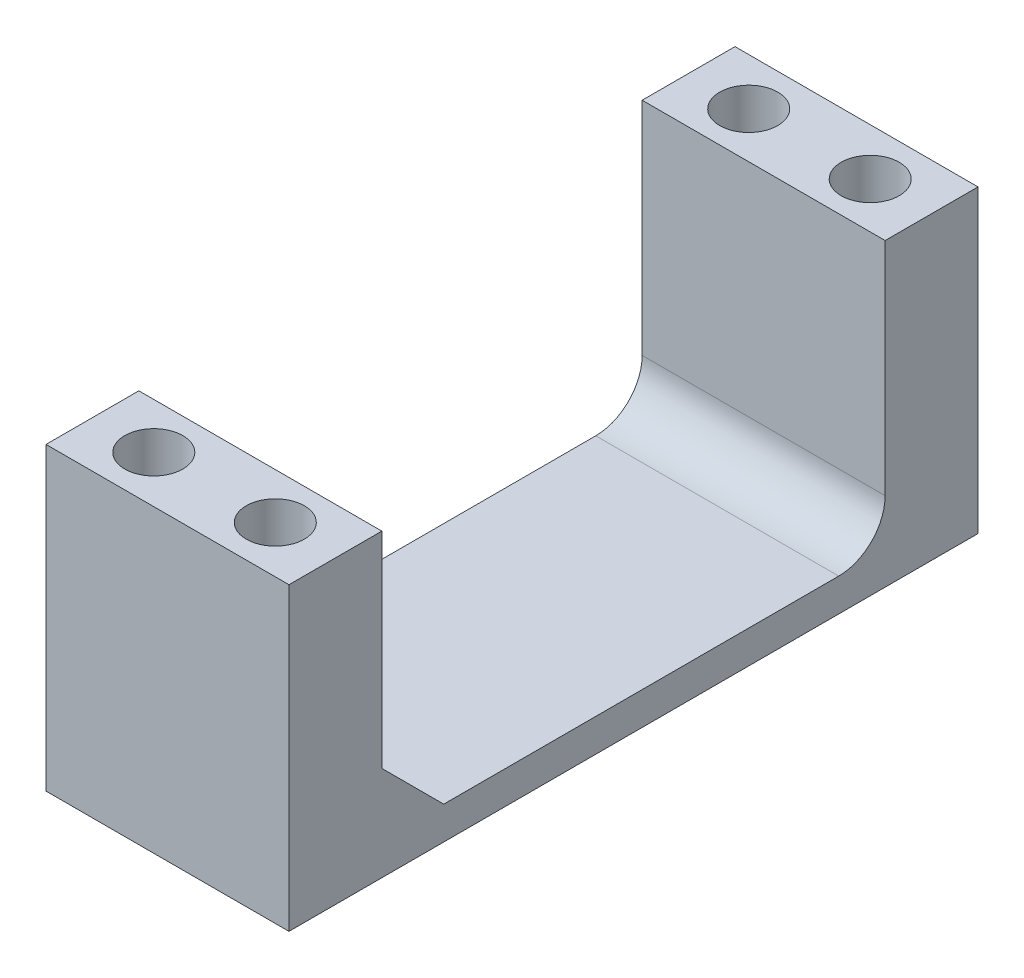
ISO-10303-21;
HEADER;
FILE_DESCRIPTION(('STEP AP214'),'2;1');
FILE_NAME('part.step','',(''),(''),'','','');
FILE_SCHEMA(('AUTOMOTIVE_DESIGN { 1 0 10303 214 1 1 1 1 }'));
ENDSEC;
DATA;
#1=APPLICATION_CONTEXT('core data for automotive mechanical design processes');
#2=APPLICATION_PROTOCOL_DEFINITION('international standard','automotive_design',2000,#1);
#3=PRODUCT_CONTEXT('',#1,'mechanical');
#4=PRODUCT('Part','Part','',(#3));
#5=PRODUCT_RELATED_PRODUCT_CATEGORY('part','',(#4));
#6=PRODUCT_DEFINITION_FORMATION('','',#4);
#7=PRODUCT_DEFINITION_CONTEXT('part definition',#1,'design');
#8=PRODUCT_DEFINITION('design','',#6,#7);
#9=PRODUCT_DEFINITION_SHAPE('','',#8);
#10=(LENGTH_UNIT() NAMED_UNIT(*) SI_UNIT(.MILLI.,.METRE.));
#11=(NAMED_UNIT(*) PLANE_ANGLE_UNIT() SI_UNIT($,.RADIAN.));
#12=(NAMED_UNIT(*) SI_UNIT($,.STERADIAN.) SOLID_ANGLE_UNIT());
#13=UNCERTAINTY_MEASURE_WITH_UNIT(LENGTH_MEASURE(1.E-05),#10,'distance_accuracy_value','');
#14=(GEOMETRIC_REPRESENTATION_CONTEXT(3) GLOBAL_UNCERTAINTY_ASSIGNED_CONTEXT((#13)) GLOBAL_UNIT_ASSIGNED_CONTEXT((#10,
#11,#12)) REPRESENTATION_CONTEXT('',''));
#15=CARTESIAN_POINT('',(0.,0.,0.));
#16=DIRECTION('',(0.,0.,1.));
#17=DIRECTION('',(1.,0.,0.));
#18=AXIS2_PLACEMENT_3D('',#15,#16,#17);
#19=CARTESIAN_POINT('',(44.4602134747078,3.59191471698541,-38.4071046370634));
#20=DIRECTION('',(0.,1.,0.));
#21=DIRECTION('',(0.,0.,1.));
#22=AXIS2_PLACEMENT_3D('',#19,#20,#21);
#23=PLANE('',#22);
#24=CARTESIAN_POINT('',(59.4144634747078,3.59191471698541,-34.5463046370634));
#25=DIRECTION('',(0.,1.,0.));
#26=DIRECTION('',(0.,0.,1.));
#27=AXIS2_PLACEMENT_3D('',#24,#25,#26);
#28=CIRCLE('',#27,2.38125);
#29=CARTESIAN_POINT('',(59.4144634747078,3.59191471698541,-32.1650546370634));
#30=VERTEX_POINT('',#29);
#31=EDGE_CURVE('E283',#30,#30,#28,.T.);
#32=ORIENTED_EDGE('',*,*,#31,.F.);
#33=EDGE_LOOP('',(#32));
#34=FACE_BOUND('',#33,.T.);
#35=CARTESIAN_POINT('',(49.4449634747078,3.59191471698541,-34.5463046370634));
#36=DIRECTION('',(0.,1.,0.));
#37=DIRECTION('',(0.,0.,1.));
#38=AXIS2_PLACEMENT_3D('',#35,#36,#37);
#39=CIRCLE('',#38,2.38125);
#40=CARTESIAN_POINT('',(49.4449634747078,3.59191471698541,-32.1650546370634));
#41=VERTEX_POINT('',#40);
#42=EDGE_CURVE('E288',#41,#41,#39,.T.);
#43=ORIENTED_EDGE('',*,*,#42,.F.);
#44=EDGE_LOOP('',(#43));
#45=FACE_BOUND('',#44,.T.);
#46=DIRECTION('',(0.,0.,1.));
#47=VECTOR('',#46,1.);
#48=CARTESIAN_POINT('',(64.3992134747078,3.59191471698541,-38.4071046370634));
#49=LINE('',#48,#47);
#50=CARTESIAN_POINT('',(64.3992134747078,3.59191471698541,-38.4071046370634));
#51=VERTEX_POINT('',#50);
#52=CARTESIAN_POINT('',(64.3992134747078,3.59191471698541,-30.7871046370634));
#53=VERTEX_POINT('',#52);
#54=EDGE_CURVE('E154',#51,#53,#49,.T.);
#55=ORIENTED_EDGE('',*,*,#54,.F.);
#56=DIRECTION('',(1.,0.,0.));
#57=VECTOR('',#56,1.);
#58=CARTESIAN_POINT('',(44.4602134747078,3.59191471698541,-38.4071046370634));
#59=LINE('',#58,#57);
#60=CARTESIAN_POINT('',(44.4602134747078,3.59191471698541,-38.4071046370634));
#61=VERTEX_POINT('',#60);
#62=EDGE_CURVE('E131',#61,#51,#59,.T.);
#63=ORIENTED_EDGE('',*,*,#62,.F.);
#64=DIRECTION('',(0.,0.,1.));
#65=VECTOR('',#64,1.);
#66=CARTESIAN_POINT('',(44.4602134747078,3.59191471698541,-38.4071046370634));
#67=LINE('',#66,#65);
#68=CARTESIAN_POINT('',(44.4602134747078,3.59191471698541,-30.7871046370634));
#69=VERTEX_POINT('',#68);
#70=EDGE_CURVE('E126',#61,#69,#67,.T.);
#71=ORIENTED_EDGE('',*,*,#70,.T.);
#72=DIRECTION('',(1.,0.,0.));
#73=VECTOR('',#72,1.);
#74=CARTESIAN_POINT('',(44.4602134747078,3.59191471698541,-30.7871046370634));
#75=LINE('',#74,#73);
#76=EDGE_CURVE('E108',#69,#53,#75,.T.);
#77=ORIENTED_EDGE('',*,*,#76,.T.);
#78=EDGE_LOOP('',(#55,#63,#71,#77));
#79=FACE_BOUND('',#78,.T.);
#80=ADVANCED_FACE('F33',(#34,#45,#79),#23,.T.);
#81=CARTESIAN_POINT('',(44.4602134747078,-21.0460852830146,-38.4071046370634));
#82=DIRECTION('',(0.,0.,-1.));
#83=DIRECTION('',(-1.,0.,0.));
#84=AXIS2_PLACEMENT_3D('',#81,#82,#83);
#85=PLANE('',#84);
#86=DIRECTION('',(0.,1.,0.));
#87=VECTOR('',#86,1.);
#88=CARTESIAN_POINT('',(64.3992134747078,-21.0460852830146,-38.4071046370634));
#89=LINE('',#88,#87);
#90=CARTESIAN_POINT('',(64.3992134747078,-21.0460852830146,-38.4071046370634));
#91=VERTEX_POINT('',#90);
#92=EDGE_CURVE('E132',#91,#51,#89,.T.);
#93=ORIENTED_EDGE('',*,*,#92,.F.);
#94=DIRECTION('',(1.,0.,0.));
#95=VECTOR('',#94,1.);
#96=CARTESIAN_POINT('',(44.4602134747078,-21.0460852830146,-38.4071046370634));
#97=LINE('',#96,#95);
#98=CARTESIAN_POINT('',(44.4602134747078,-21.0460852830146,-38.4071046370634));
#99=VERTEX_POINT('',#98);
#100=EDGE_CURVE('E171',#99,#91,#97,.T.);
#101=ORIENTED_EDGE('',*,*,#100,.F.);
#102=DIRECTION('',(0.,1.,0.));
#103=VECTOR('',#102,1.);
#104=CARTESIAN_POINT('',(44.4602134747078,-21.0460852830146,-38.4071046370634));
#105=LINE('',#104,#103);
#106=EDGE_CURVE('E120',#99,#61,#105,.T.);
#107=ORIENTED_EDGE('',*,*,#106,.T.);
#108=ORIENTED_EDGE('',*,*,#62,.T.);
#109=EDGE_LOOP('',(#93,#101,#107,#108));
#110=FACE_BOUND('',#109,.T.);
#111=ADVANCED_FACE('F195',(#110),#85,.T.);
#112=CARTESIAN_POINT('',(44.4602134747078,-21.0460852830146,18.1332953629366));
#113=DIRECTION('',(0.,-1.,0.));
#114=DIRECTION('',(0.,0.,-1.));
#115=AXIS2_PLACEMENT_3D('',#112,#113,#114);
#116=PLANE('',#115);
#117=CARTESIAN_POINT('',(59.4144634747078,-21.0460852830146,14.2724953629366));
#118=DIRECTION('',(0.,1.,0.));
#119=DIRECTION('',(0.,0.,1.));
#120=AXIS2_PLACEMENT_3D('',#117,#118,#119);
#121=CIRCLE('',#120,2.38125000000001);
#122=CARTESIAN_POINT('',(59.4144634747078,-21.0460852830146,16.6537453629366));
#123=VERTEX_POINT('',#122);
#124=EDGE_CURVE('E270',#123,#123,#121,.T.);
#125=ORIENTED_EDGE('',*,*,#124,.T.);
#126=EDGE_LOOP('',(#125));
#127=FACE_BOUND('',#126,.T.);
#128=CARTESIAN_POINT('',(49.4449634747078,-21.0460852830146,14.2724953629366));
#129=DIRECTION('',(0.,1.,0.));
#130=DIRECTION('',(0.,0.,1.));
#131=AXIS2_PLACEMENT_3D('',#128,#129,#130);
#132=CIRCLE('',#131,2.38125000000001);
#133=CARTESIAN_POINT('',(49.4449634747078,-21.0460852830146,16.6537453629366));
#134=VERTEX_POINT('',#133);
#135=EDGE_CURVE('E280',#134,#134,#132,.T.);
#136=ORIENTED_EDGE('',*,*,#135,.T.);
#137=EDGE_LOOP('',(#136));
#138=FACE_BOUND('',#137,.T.);
#139=CARTESIAN_POINT('',(59.4144634747078,-21.0460852830146,-34.5463046370634));
#140=DIRECTION('',(0.,1.,0.));
#141=DIRECTION('',(0.,0.,1.));
#142=AXIS2_PLACEMENT_3D('',#139,#140,#141);
#143=CIRCLE('',#142,2.38125);
#144=CARTESIAN_POINT('',(59.4144634747078,-21.0460852830146,-32.1650546370634));
#145=VERTEX_POINT('',#144);
#146=EDGE_CURVE('E286',#145,#145,#143,.T.);
#147=ORIENTED_EDGE('',*,*,#146,.T.);
#148=EDGE_LOOP('',(#147));
#149=FACE_BOUND('',#148,.T.);
#150=CARTESIAN_POINT('',(49.4449634747078,-21.0460852830146,-34.5463046370634));
#151=DIRECTION('',(0.,1.,0.));
#152=DIRECTION('',(0.,0.,1.));
#153=AXIS2_PLACEMENT_3D('',#150,#151,#152);
#154=CIRCLE('',#153,2.38125);
#155=CARTESIAN_POINT('',(49.4449634747078,-21.0460852830146,-32.1650546370634));
#156=VERTEX_POINT('',#155);
#157=EDGE_CURVE('E138',#156,#156,#154,.T.);
#158=ORIENTED_EDGE('',*,*,#157,.T.);
#159=EDGE_LOOP('',(#158));
#160=FACE_BOUND('',#159,.T.);
#161=DIRECTION('',(0.,0.,-1.));
#162=VECTOR('',#161,1.);
#163=CARTESIAN_POINT('',(64.3992134747078,-21.0460852830146,18.1332953629366));
#164=LINE('',#163,#162);
#165=CARTESIAN_POINT('',(64.3992134747078,-21.0460852830146,18.1332953629366));
#166=VERTEX_POINT('',#165);
#167=EDGE_CURVE('E135',#166,#91,#164,.T.);
#168=ORIENTED_EDGE('',*,*,#167,.F.);
#169=DIRECTION('',(1.,0.,0.));
#170=VECTOR('',#169,1.);
#171=CARTESIAN_POINT('',(44.4602134747078,-21.0460852830146,18.1332953629366));
#172=LINE('',#171,#170);
#173=CARTESIAN_POINT('',(44.4602134747078,-21.0460852830146,18.1332953629366));
#174=VERTEX_POINT('',#173);
#175=EDGE_CURVE('E173',#174,#166,#172,.T.);
#176=ORIENTED_EDGE('',*,*,#175,.F.);
#177=DIRECTION('',(0.,0.,-1.));
#178=VECTOR('',#177,1.);
#179=CARTESIAN_POINT('',(44.4602134747078,-21.0460852830146,18.1332953629366));
#180=LINE('',#179,#178);
#181=EDGE_CURVE('E150',#174,#99,#180,.T.);
#182=ORIENTED_EDGE('',*,*,#181,.T.);
#183=ORIENTED_EDGE('',*,*,#100,.T.);
#184=EDGE_LOOP('',(#168,#176,#182,#183));
#185=FACE_BOUND('',#184,.T.);
#186=ADVANCED_FACE('F231',(#127,#138,#149,#160,#185),#116,.T.);
#187=CARTESIAN_POINT('',(44.4602134747078,3.59191471698541,18.1332953629366));
#188=DIRECTION('',(0.,0.,1.));
#189=DIRECTION('',(0.,-1.,0.));
#190=AXIS2_PLACEMENT_3D('',#187,#188,#189);
#191=PLANE('',#190);
#192=DIRECTION('',(0.,-1.,0.));
#193=VECTOR('',#192,1.);
#194=CARTESIAN_POINT('',(64.3992134747078,3.59191471698541,18.1332953629366));
#195=LINE('',#194,#193);
#196=CARTESIAN_POINT('',(64.3992134747078,3.59191471698541,18.1332953629366));
#197=VERTEX_POINT('',#196);
#198=EDGE_CURVE('E164',#197,#166,#195,.T.);
#199=ORIENTED_EDGE('',*,*,#198,.F.);
#200=DIRECTION('',(1.,0.,0.));
#201=VECTOR('',#200,1.);
#202=CARTESIAN_POINT('',(44.4602134747078,3.59191471698541,18.1332953629366));
#203=LINE('',#202,#201);
#204=CARTESIAN_POINT('',(44.4602134747078,3.59191471698541,18.1332953629366));
#205=VERTEX_POINT('',#204);
#206=EDGE_CURVE('E175',#205,#197,#203,.T.);
#207=ORIENTED_EDGE('',*,*,#206,.F.);
#208=DIRECTION('',(0.,-1.,0.));
#209=VECTOR('',#208,1.);
#210=CARTESIAN_POINT('',(44.4602134747078,3.59191471698541,18.1332953629366));
#211=LINE('',#210,#209);
#212=EDGE_CURVE('E147',#205,#174,#211,.T.);
#213=ORIENTED_EDGE('',*,*,#212,.T.);
#214=ORIENTED_EDGE('',*,*,#175,.T.);
#215=EDGE_LOOP('',(#199,#207,#213,#214));
#216=FACE_BOUND('',#215,.T.);
#217=ADVANCED_FACE('F202',(#216),#191,.T.);
#218=CARTESIAN_POINT('',(44.4602134747078,3.59191471698541,10.5132953629366));
#219=DIRECTION('',(0.,1.,0.));
#220=DIRECTION('',(0.,0.,1.));
#221=AXIS2_PLACEMENT_3D('',#218,#219,#220);
#222=PLANE('',#221);
#223=CARTESIAN_POINT('',(59.4144634747078,3.59191471698541,14.2724953629366));
#224=DIRECTION('',(0.,1.,0.));
#225=DIRECTION('',(0.,0.,1.));
#226=AXIS2_PLACEMENT_3D('',#223,#224,#225);
#227=CIRCLE('',#226,2.38125000000001);
#228=CARTESIAN_POINT('',(59.4144634747078,3.59191471698541,16.6537453629366));
#229=VERTEX_POINT('',#228);
#230=EDGE_CURVE('E273',#229,#229,#227,.T.);
#231=ORIENTED_EDGE('',*,*,#230,.F.);
#232=EDGE_LOOP('',(#231));
#233=FACE_BOUND('',#232,.T.);
#234=CARTESIAN_POINT('',(49.4449634747078,3.59191471698541,14.2724953629366));
#235=DIRECTION('',(0.,1.,0.));
#236=DIRECTION('',(0.,0.,1.));
#237=AXIS2_PLACEMENT_3D('',#234,#235,#236);
#238=CIRCLE('',#237,2.38125000000001);
#239=CARTESIAN_POINT('',(49.4449634747078,3.59191471698541,16.6537453629366));
#240=VERTEX_POINT('',#239);
#241=EDGE_CURVE('E275',#240,#240,#238,.T.);
#242=ORIENTED_EDGE('',*,*,#241,.F.);
#243=EDGE_LOOP('',(#242));
#244=FACE_BOUND('',#243,.T.);
#245=DIRECTION('',(0.,0.,1.));
#246=VECTOR('',#245,1.);
#247=CARTESIAN_POINT('',(64.3992134747078,3.59191471698541,10.5132953629366));
#248=LINE('',#247,#246);
#249=CARTESIAN_POINT('',(64.3992134747078,3.59191471698541,10.5132953629366));
#250=VERTEX_POINT('',#249);
#251=EDGE_CURVE('E161',#250,#197,#248,.T.);
#252=ORIENTED_EDGE('',*,*,#251,.F.);
#253=DIRECTION('',(1.,0.,0.));
#254=VECTOR('',#253,1.);
#255=CARTESIAN_POINT('',(44.4602134747078,3.59191471698541,10.5132953629366));
#256=LINE('',#255,#254);
#257=CARTESIAN_POINT('',(44.4602134747078,3.59191471698541,10.5132953629366));
#258=VERTEX_POINT('',#257);
#259=EDGE_CURVE('E119',#258,#250,#256,.T.);
#260=ORIENTED_EDGE('',*,*,#259,.F.);
#261=DIRECTION('',(0.,0.,1.));
#262=VECTOR('',#261,1.);
#263=CARTESIAN_POINT('',(44.4602134747078,3.59191471698541,10.5132953629366));
#264=LINE('',#263,#262);
#265=EDGE_CURVE('E144',#258,#205,#264,.T.);
#266=ORIENTED_EDGE('',*,*,#265,.T.);
#267=ORIENTED_EDGE('',*,*,#206,.T.);
#268=EDGE_LOOP('',(#252,#260,#266,#267));
#269=FACE_BOUND('',#268,.T.);
#270=ADVANCED_FACE('F205',(#233,#244,#269),#222,.T.);
#271=CARTESIAN_POINT('',(44.4602134747078,-18.3520572575426,10.5132953629366));
#272=DIRECTION('',(0.,0.,-1.));
#273=DIRECTION('',(0.,1.,0.));
#274=AXIS2_PLACEMENT_3D('',#271,#272,#273);
#275=PLANE('',#274);
#276=DIRECTION('',(0.,1.,0.));
#277=VECTOR('',#276,1.);
#278=CARTESIAN_POINT('',(64.3992134747078,-18.3520572575426,10.5132953629366));
#279=LINE('',#278,#277);
#280=CARTESIAN_POINT('',(64.3992134747078,-13.2720572575426,10.5132953629366));
#281=VERTEX_POINT('',#280);
#282=EDGE_CURVE('E159',#281,#250,#279,.T.);
#283=ORIENTED_EDGE('',*,*,#282,.F.);
#284=DIRECTION('',(-1.,0.,0.));
#285=VECTOR('',#284,1.);
#286=CARTESIAN_POINT('',(44.4602134747078,-13.2720572575426,10.5132953629366));
#287=LINE('',#286,#285);
#288=CARTESIAN_POINT('',(44.4602134747078,-13.2720572575426,10.5132953629366));
#289=VERTEX_POINT('',#288);
#290=EDGE_CURVE('E181',#281,#289,#287,.T.);
#291=ORIENTED_EDGE('',*,*,#290,.T.);
#292=DIRECTION('',(0.,1.,0.));
#293=VECTOR('',#292,1.);
#294=CARTESIAN_POINT('',(44.4602134747078,-18.3520572575426,10.5132953629366));
#295=LINE('',#294,#293);
#296=EDGE_CURVE('E142',#289,#258,#295,.T.);
#297=ORIENTED_EDGE('',*,*,#296,.T.);
#298=ORIENTED_EDGE('',*,*,#259,.T.);
#299=EDGE_LOOP('',(#283,#291,#297,#298));
#300=FACE_BOUND('',#299,.T.);
#301=ADVANCED_FACE('F240',(#300),#275,.T.);
#302=CARTESIAN_POINT('',(44.4602134747078,-18.3520572575426,-30.7871046370634));
#303=DIRECTION('',(0.,1.,0.));
#304=DIRECTION('',(0.,0.,1.));
#305=AXIS2_PLACEMENT_3D('',#302,#303,#304);
#306=PLANE('',#305);
#307=DIRECTION('',(0.,0.,1.));
#308=VECTOR('',#307,1.);
#309=CARTESIAN_POINT('',(64.3992134747078,-18.3520572575426,-30.7871046370634));
#310=LINE('',#309,#308);
#311=CARTESIAN_POINT('',(64.3992134747078,-18.3520572575426,-26.9771046370634));
#312=VERTEX_POINT('',#311);
#313=CARTESIAN_POINT('',(64.3992134747078,-18.3520572575426,5.43329536293658));
#314=VERTEX_POINT('',#313);
#315=EDGE_CURVE('E157',#312,#314,#310,.T.);
#316=ORIENTED_EDGE('',*,*,#315,.F.);
#317=DIRECTION('',(1.,0.,0.));
#318=VECTOR('',#317,1.);
#319=CARTESIAN_POINT('',(44.4602134747078,-18.3520572575426,-26.9771046370634));
#320=LINE('',#319,#318);
#321=CARTESIAN_POINT('',(44.4602134747078,-18.3520572575426,-26.9771046370634));
#322=VERTEX_POINT('',#321);
#323=EDGE_CURVE('E54',#312,#322,#320,.F.);
#324=ORIENTED_EDGE('',*,*,#323,.T.);
#325=DIRECTION('',(0.,0.,1.));
#326=VECTOR('',#325,1.);
#327=CARTESIAN_POINT('',(44.4602134747078,-18.3520572575426,-30.7871046370634));
#328=LINE('',#327,#326);
#329=CARTESIAN_POINT('',(44.4602134747078,-18.3520572575426,5.43329536293658));
#330=VERTEX_POINT('',#329);
#331=EDGE_CURVE('E129',#322,#330,#328,.T.);
#332=ORIENTED_EDGE('',*,*,#331,.T.);
#333=DIRECTION('',(1.,0.,0.));
#334=VECTOR('',#333,1.);
#335=CARTESIAN_POINT('',(64.3992134747078,-18.3520572575426,5.43329536293658));
#336=LINE('',#335,#334);
#337=EDGE_CURVE('E170',#330,#314,#336,.T.);
#338=ORIENTED_EDGE('',*,*,#337,.T.);
#339=EDGE_LOOP('',(#316,#324,#332,#338));
#340=FACE_BOUND('',#339,.T.);
#341=ADVANCED_FACE('F215',(#340),#306,.T.);
#342=CARTESIAN_POINT('',(44.4602134747078,3.59191471698541,-30.7871046370634));
#343=DIRECTION('',(0.,0.,1.));
#344=DIRECTION('',(0.,-1.,0.));
#345=AXIS2_PLACEMENT_3D('',#342,#343,#344);
#346=PLANE('',#345);
#347=DIRECTION('',(0.,-1.,0.));
#348=VECTOR('',#347,1.);
#349=CARTESIAN_POINT('',(44.4602134747078,3.59191471698541,-30.7871046370634));
#350=LINE('',#349,#348);
#351=CARTESIAN_POINT('',(44.4602134747078,-14.5420572575426,-30.7871046370634));
#352=VERTEX_POINT('',#351);
#353=EDGE_CURVE('E112',#69,#352,#350,.T.);
#354=ORIENTED_EDGE('',*,*,#353,.T.);
#355=DIRECTION('',(1.,0.,0.));
#356=VECTOR('',#355,1.);
#357=CARTESIAN_POINT('',(64.3992134747078,-14.5420572575426,-30.7871046370634));
#358=LINE('',#357,#356);
#359=CARTESIAN_POINT('',(64.3992134747078,-14.5420572575426,-30.7871046370634));
#360=VERTEX_POINT('',#359);
#361=EDGE_CURVE('E188',#352,#360,#358,.T.);
#362=ORIENTED_EDGE('',*,*,#361,.T.);
#363=DIRECTION('',(0.,-1.,0.));
#364=VECTOR('',#363,1.);
#365=CARTESIAN_POINT('',(64.3992134747078,3.59191471698541,-30.7871046370634));
#366=LINE('',#365,#364);
#367=EDGE_CURVE('E114',#53,#360,#366,.T.);
#368=ORIENTED_EDGE('',*,*,#367,.F.);
#369=ORIENTED_EDGE('',*,*,#76,.F.);
#370=EDGE_LOOP('',(#354,#362,#368,#369));
#371=FACE_BOUND('',#370,.T.);
#372=ADVANCED_FACE('F110',(#371),#346,.T.);
#373=CARTESIAN_POINT('',(44.4602134747078,0.,0.));
#374=DIRECTION('',(1.,0.,0.));
#375=DIRECTION('',(0.,0.,-1.));
#376=AXIS2_PLACEMENT_3D('',#373,#374,#375);
#377=PLANE('',#376);
#378=ORIENTED_EDGE('',*,*,#70,.F.);
#379=ORIENTED_EDGE('',*,*,#106,.F.);
#380=ORIENTED_EDGE('',*,*,#181,.F.);
#381=ORIENTED_EDGE('',*,*,#212,.F.);
#382=ORIENTED_EDGE('',*,*,#265,.F.);
#383=ORIENTED_EDGE('',*,*,#296,.F.);
#384=DIRECTION('',(0.,0.707106781186544,0.707106781186551));
#385=VECTOR('',#384,1.);
#386=CARTESIAN_POINT('',(44.4602134747078,-11.8926763102397,11.8926763102396));
#387=LINE('',#386,#385);
#388=EDGE_CURVE('E185',#289,#330,#387,.F.);
#389=ORIENTED_EDGE('',*,*,#388,.T.);
#390=ORIENTED_EDGE('',*,*,#331,.F.);
#391=CARTESIAN_POINT('',(44.4602134747078,-14.5420572575426,-26.9771046370634));
#392=DIRECTION('',(1.,0.,0.));
#393=DIRECTION('',(0.,0.,-1.));
#394=AXIS2_PLACEMENT_3D('',#391,#392,#393);
#395=CIRCLE('',#394,3.81);
#396=EDGE_CURVE('E11',#322,#352,#395,.T.);
#397=ORIENTED_EDGE('',*,*,#396,.T.);
#398=ORIENTED_EDGE('',*,*,#353,.F.);
#399=EDGE_LOOP('',(#378,#379,#380,#381,#382,#383,#389,#390,#397,#398));
#400=FACE_BOUND('',#399,.T.);
#401=ADVANCED_FACE('F124',(#400),#377,.F.);
#402=CARTESIAN_POINT('',(64.3992134747078,0.,0.));
#403=DIRECTION('',(1.,0.,0.));
#404=DIRECTION('',(0.,0.,-1.));
#405=AXIS2_PLACEMENT_3D('',#402,#403,#404);
#406=PLANE('',#405);
#407=ORIENTED_EDGE('',*,*,#54,.T.);
#408=ORIENTED_EDGE('',*,*,#367,.T.);
#409=CARTESIAN_POINT('',(64.3992134747078,-14.5420572575426,-26.9771046370634));
#410=DIRECTION('',(1.,0.,0.));
#411=DIRECTION('',(0.,0.,-1.));
#412=AXIS2_PLACEMENT_3D('',#409,#410,#411);
#413=CIRCLE('',#412,3.81);
#414=EDGE_CURVE('E41',#360,#312,#413,.F.);
#415=ORIENTED_EDGE('',*,*,#414,.T.);
#416=ORIENTED_EDGE('',*,*,#315,.T.);
#417=DIRECTION('',(0.,-0.707106781186544,-0.707106781186551));
#418=VECTOR('',#417,1.);
#419=CARTESIAN_POINT('',(64.3992134747078,-18.3520572575426,5.43329536293658));
#420=LINE('',#419,#418);
#421=EDGE_CURVE('E183',#314,#281,#420,.F.);
#422=ORIENTED_EDGE('',*,*,#421,.T.);
#423=ORIENTED_EDGE('',*,*,#282,.T.);
#424=ORIENTED_EDGE('',*,*,#251,.T.);
#425=ORIENTED_EDGE('',*,*,#198,.T.);
#426=ORIENTED_EDGE('',*,*,#167,.T.);
#427=ORIENTED_EDGE('',*,*,#92,.T.);
#428=EDGE_LOOP('',(#407,#408,#415,#416,#422,#423,#424,#425,#426,#427));
#429=FACE_BOUND('',#428,.T.);
#430=ADVANCED_FACE('F191',(#429),#406,.T.);
#431=CARTESIAN_POINT('',(44.4602134747078,-18.3520572575426,5.43329536293658));
#432=DIRECTION('',(0.,0.707106781186551,-0.707106781186544));
#433=DIRECTION('',(-1.,0.,0.));
#434=AXIS2_PLACEMENT_3D('',#431,#432,#433);
#435=PLANE('',#434);
#436=ORIENTED_EDGE('',*,*,#388,.F.);
#437=ORIENTED_EDGE('',*,*,#290,.F.);
#438=ORIENTED_EDGE('',*,*,#421,.F.);
#439=ORIENTED_EDGE('',*,*,#337,.F.);
#440=EDGE_LOOP('',(#436,#437,#438,#439));
#441=FACE_BOUND('',#440,.T.);
#442=ADVANCED_FACE('F213',(#441),#435,.T.);
#443=CARTESIAN_POINT('',(44.4602134747078,-14.5420572575426,-26.9771046370634));
#444=DIRECTION('',(-1.,0.,0.));
#445=DIRECTION('',(0.,0.,1.));
#446=AXIS2_PLACEMENT_3D('',#443,#444,#445);
#447=CYLINDRICAL_SURFACE('',#446,3.81);
#448=ORIENTED_EDGE('',*,*,#396,.F.);
#449=ORIENTED_EDGE('',*,*,#323,.F.);
#450=ORIENTED_EDGE('',*,*,#414,.F.);
#451=ORIENTED_EDGE('',*,*,#361,.F.);
#452=EDGE_LOOP('',(#448,#449,#450,#451));
#453=FACE_BOUND('',#452,.T.);
#454=ADVANCED_FACE('F35',(#453),#447,.F.);
#455=CARTESIAN_POINT('',(49.4449634747078,-21.0460852830146,-34.5463046370634));
#456=DIRECTION('',(0.,1.,0.));
#457=DIRECTION('',(0.,0.,1.));
#458=AXIS2_PLACEMENT_3D('',#455,#456,#457);
#459=CYLINDRICAL_SURFACE('',#458,2.38125);
#460=ORIENTED_EDGE('',*,*,#157,.F.);
#461=EDGE_LOOP('',(#460));
#462=FACE_BOUND('',#461,.T.);
#463=ORIENTED_EDGE('',*,*,#42,.T.);
#464=EDGE_LOOP('',(#463));
#465=FACE_BOUND('',#464,.T.);
#466=ADVANCED_FACE('F217',(#462,#465),#459,.F.);
#467=CARTESIAN_POINT('',(59.4144634747078,-21.0460852830146,-34.5463046370634));
#468=DIRECTION('',(0.,1.,0.));
#469=DIRECTION('',(0.,0.,1.));
#470=AXIS2_PLACEMENT_3D('',#467,#468,#469);
#471=CYLINDRICAL_SURFACE('',#470,2.38125);
#472=ORIENTED_EDGE('',*,*,#146,.F.);
#473=EDGE_LOOP('',(#472));
#474=FACE_BOUND('',#473,.T.);
#475=ORIENTED_EDGE('',*,*,#31,.T.);
#476=EDGE_LOOP('',(#475));
#477=FACE_BOUND('',#476,.T.);
#478=ADVANCED_FACE('F222',(#474,#477),#471,.F.);
#479=CARTESIAN_POINT('',(49.4449634747078,-21.0460852830146,14.2724953629366));
#480=DIRECTION('',(0.,1.,0.));
#481=DIRECTION('',(0.,0.,1.));
#482=AXIS2_PLACEMENT_3D('',#479,#480,#481);
#483=CYLINDRICAL_SURFACE('',#482,2.38125000000001);
#484=ORIENTED_EDGE('',*,*,#135,.F.);
#485=EDGE_LOOP('',(#484));
#486=FACE_BOUND('',#485,.T.);
#487=ORIENTED_EDGE('',*,*,#241,.T.);
#488=EDGE_LOOP('',(#487));
#489=FACE_BOUND('',#488,.T.);
#490=ADVANCED_FACE('F257',(#486,#489),#483,.F.);
#491=CARTESIAN_POINT('',(59.4144634747078,-21.0460852830146,14.2724953629366));
#492=DIRECTION('',(0.,1.,0.));
#493=DIRECTION('',(0.,0.,1.));
#494=AXIS2_PLACEMENT_3D('',#491,#492,#493);
#495=CYLINDRICAL_SURFACE('',#494,2.38125000000001);
#496=ORIENTED_EDGE('',*,*,#124,.F.);
#497=EDGE_LOOP('',(#496));
#498=FACE_BOUND('',#497,.T.);
#499=ORIENTED_EDGE('',*,*,#230,.T.);
#500=EDGE_LOOP('',(#499));
#501=FACE_BOUND('',#500,.T.);
#502=ADVANCED_FACE('F261',(#498,#501),#495,.F.);
#503=CLOSED_SHELL('',(#80,#111,#186,#217,#270,#301,#341,#372,#401,#430,#442,#454,#466,#478,#490,#502));
#504=MANIFOLD_SOLID_BREP('B2',#503);
#505=ADVANCED_BREP_SHAPE_REPRESENTATION('',(#18,#504),#14);
#506=SHAPE_DEFINITION_REPRESENTATION(#9,#505);
ENDSEC;
END-ISO-10303-21;
